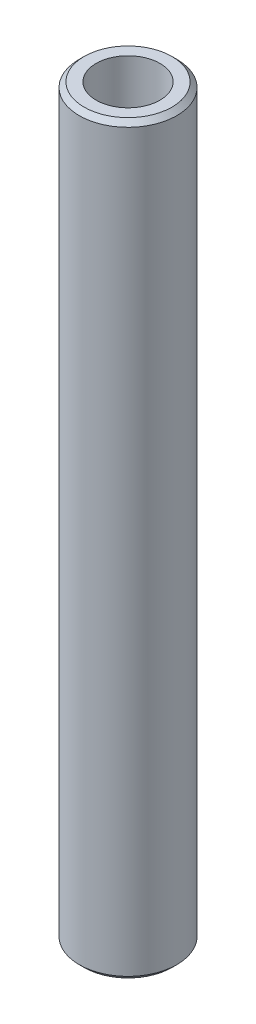
ISO-10303-21;
HEADER;
FILE_DESCRIPTION(('STEP AP214'),'2;1');
FILE_NAME('part.step','',(''),(''),'','','');
FILE_SCHEMA(('AUTOMOTIVE_DESIGN { 1 0 10303 214 1 1 1 1 }'));
ENDSEC;
DATA;
#1=APPLICATION_CONTEXT('core data for automotive mechanical design processes');
#2=APPLICATION_PROTOCOL_DEFINITION('international standard','automotive_design',2000,#1);
#3=PRODUCT_CONTEXT('',#1,'mechanical');
#4=PRODUCT('Part','Part','',(#3));
#5=PRODUCT_RELATED_PRODUCT_CATEGORY('part','',(#4));
#6=PRODUCT_DEFINITION_FORMATION('','',#4);
#7=PRODUCT_DEFINITION_CONTEXT('part definition',#1,'design');
#8=PRODUCT_DEFINITION('design','',#6,#7);
#9=PRODUCT_DEFINITION_SHAPE('','',#8);
#10=(LENGTH_UNIT() NAMED_UNIT(*) SI_UNIT(.MILLI.,.METRE.));
#11=(NAMED_UNIT(*) PLANE_ANGLE_UNIT() SI_UNIT($,.RADIAN.));
#12=(NAMED_UNIT(*) SI_UNIT($,.STERADIAN.) SOLID_ANGLE_UNIT());
#13=UNCERTAINTY_MEASURE_WITH_UNIT(LENGTH_MEASURE(1.E-05),#10,'distance_accuracy_value','');
#14=(GEOMETRIC_REPRESENTATION_CONTEXT(3) GLOBAL_UNCERTAINTY_ASSIGNED_CONTEXT((#13)) GLOBAL_UNIT_ASSIGNED_CONTEXT((#10,
#11,#12)) REPRESENTATION_CONTEXT('',''));
#15=CARTESIAN_POINT('',(0.,0.,0.));
#16=DIRECTION('',(0.,0.,1.));
#17=DIRECTION('',(1.,0.,0.));
#18=AXIS2_PLACEMENT_3D('',#15,#16,#17);
#19=CARTESIAN_POINT('',(0.,343.356689763253,0.));
#20=DIRECTION('',(0.,-1.,0.));
#21=DIRECTION('',(0.,0.,-1.));
#22=AXIS2_PLACEMENT_3D('',#19,#20,#21);
#23=CYLINDRICAL_SURFACE('',#22,22.5);
#24=CARTESIAN_POINT('',(0.,341.094203052417,0.));
#25=DIRECTION('',(0.,1.,0.));
#26=DIRECTION('',(0.,0.,1.));
#27=AXIS2_PLACEMENT_3D('',#24,#25,#26);
#28=CIRCLE('',#27,22.5);
#29=CARTESIAN_POINT('',(0.,341.094203052417,-22.5));
#30=VERTEX_POINT('',#29);
#31=EDGE_CURVE('E50',#30,#30,#28,.F.);
#32=CARTESIAN_POINT('',(0.,2.26248671083679,0.));
#33=DIRECTION('',(0.,1.,0.));
#34=DIRECTION('',(0.,0.,1.));
#35=AXIS2_PLACEMENT_3D('',#32,#33,#34);
#36=CIRCLE('',#35,22.5);
#37=CARTESIAN_POINT('',(0.,2.26248671083679,-22.5));
#38=VERTEX_POINT('',#37);
#39=EDGE_CURVE('E51',#38,#38,#36,.T.);
#40=CARTESIAN_POINT('',(0.,341.094203052417,-22.5));
#41=CARTESIAN_POINT('',(0.,337.564706007192,-22.5));
#42=CARTESIAN_POINT('',(0.,334.035208961967,-22.5));
#43=CARTESIAN_POINT('',(0.,326.976214871518,-22.5));
#44=CARTESIAN_POINT('',(0.,323.446717826293,-22.5));
#45=CARTESIAN_POINT('',(0.,316.387723735843,-22.5));
#46=CARTESIAN_POINT('',(0.,312.858226690619,-22.5));
#47=CARTESIAN_POINT('',(0.,305.799232600169,-22.5));
#48=CARTESIAN_POINT('',(0.,302.269735554944,-22.5));
#49=CARTESIAN_POINT('',(0.,295.210741464495,-22.5));
#50=CARTESIAN_POINT('',(0.,291.68124441927,-22.5));
#51=CARTESIAN_POINT('',(0.,284.62225032882,-22.5));
#52=CARTESIAN_POINT('',(0.,281.092753283596,-22.5));
#53=CARTESIAN_POINT('',(0.,274.033759193146,-22.5));
#54=CARTESIAN_POINT('',(0.,270.504262147921,-22.5));
#55=CARTESIAN_POINT('',(0.,263.445268057472,-22.5));
#56=CARTESIAN_POINT('',(0.,259.915771012247,-22.5));
#57=CARTESIAN_POINT('',(0.,252.856776921797,-22.5));
#58=CARTESIAN_POINT('',(0.,249.327279876572,-22.5));
#59=CARTESIAN_POINT('',(0.,242.268285786123,-22.5));
#60=CARTESIAN_POINT('',(0.,238.738788740898,-22.5));
#61=CARTESIAN_POINT('',(0.,231.679794650448,-22.5));
#62=CARTESIAN_POINT('',(0.,228.150297605224,-22.5));
#63=CARTESIAN_POINT('',(0.,221.091303514774,-22.5));
#64=CARTESIAN_POINT('',(0.,217.561806469549,-22.5));
#65=CARTESIAN_POINT('',(0.,210.5028123791,-22.5));
#66=CARTESIAN_POINT('',(0.,206.973315333875,-22.5));
#67=CARTESIAN_POINT('',(0.,199.914321243425,-22.5));
#68=CARTESIAN_POINT('',(0.,196.3848241982,-22.5));
#69=CARTESIAN_POINT('',(0.,189.325830107751,-22.5));
#70=CARTESIAN_POINT('',(0.,185.796333062526,-22.5));
#71=CARTESIAN_POINT('',(0.,178.737338972077,-22.5));
#72=CARTESIAN_POINT('',(0.,175.207841926852,-22.5));
#73=CARTESIAN_POINT('',(0.,168.148847836402,-22.5));
#74=CARTESIAN_POINT('',(0.,164.619350791177,-22.5));
#75=CARTESIAN_POINT('',(0.,157.560356700728,-22.5));
#76=CARTESIAN_POINT('',(0.,154.030859655503,-22.5));
#77=CARTESIAN_POINT('',(0.,146.971865565053,-22.5));
#78=CARTESIAN_POINT('',(0.,143.442368519829,-22.5));
#79=CARTESIAN_POINT('',(0.,136.383374429379,-22.5));
#80=CARTESIAN_POINT('',(0.,132.853877384154,-22.5));
#81=CARTESIAN_POINT('',(0.,125.794883293705,-22.5));
#82=CARTESIAN_POINT('',(0.,122.26538624848,-22.5));
#83=CARTESIAN_POINT('',(0.,115.20639215803,-22.5));
#84=CARTESIAN_POINT('',(0.,111.676895112805,-22.5));
#85=CARTESIAN_POINT('',(0.,104.617901022356,-22.5));
#86=CARTESIAN_POINT('',(0.,101.088403977131,-22.5));
#87=CARTESIAN_POINT('',(0.,94.0294098866814,-22.5));
#88=CARTESIAN_POINT('',(0.,90.4999128414566,-22.5));
#89=CARTESIAN_POINT('',(0.,83.4409187510071,-22.5));
#90=CARTESIAN_POINT('',(0.,79.9114217057823,-22.5));
#91=CARTESIAN_POINT('',(0.,72.8524276153327,-22.5));
#92=CARTESIAN_POINT('',(0.,69.322930570108,-22.5));
#93=CARTESIAN_POINT('',(0.,62.2639364796584,-22.5));
#94=CARTESIAN_POINT('',(0.,58.7344394344336,-22.5));
#95=CARTESIAN_POINT('',(0.,51.675445343984,-22.5));
#96=CARTESIAN_POINT('',(0.,48.1459482987592,-22.5));
#97=CARTESIAN_POINT('',(0.,41.0869542083096,-22.5));
#98=CARTESIAN_POINT('',(0.,37.5574571630848,-22.5));
#99=CARTESIAN_POINT('',(0.,30.4984630726352,-22.5));
#100=CARTESIAN_POINT('',(0.,26.9689660274104,-22.5));
#101=CARTESIAN_POINT('',(0.,19.9099719369608,-22.5));
#102=CARTESIAN_POINT('',(0.,16.380474891736,-22.5));
#103=CARTESIAN_POINT('',(0.,9.32148080128638,-22.5));
#104=CARTESIAN_POINT('',(0.,5.79198375606158,-22.5));
#105=CARTESIAN_POINT('',(0.,2.26248671083679,-22.5));
#106=B_SPLINE_CURVE_WITH_KNOTS('',3,(#40,#41,#42,#43,#44,#45,#46,#47,#48,#49,#50,#51,#52,#53,
#54,#55,#56,#57,#58,#59,#60,#61,#62,#63,#64,#65,#66,#67,#68,#69,#70,#71,#72,#73,#74,#75,#76,#77,
#78,#79,#80,#81,#82,#83,#84,#85,#86,#87,#88,#89,#90,#91,#92,#93,#94,#95,#96,#97,#98,#99,#100,
#101,#102,#103,#104,#105),.UNSPECIFIED.,.F.,.F.,(4,2,2,2,2,2,2,2,2,2,2,2,2,2,2,2,2,2,2,2,2,2,2,
2,2,2,2,2,2,2,2,2,4),(0.,10.5884911356744,21.1769822713488,31.7654734070232,42.3539645426976,
52.9424556783719,63.5309468140463,74.1194379497207,84.7079290853951,95.2964202210695,
105.884911356744,116.473402492418,127.061893628093,137.650384763767,148.238875899441,
158.827367035116,169.41585817079,180.004349306465,190.592840442139,201.181331577813,
211.769822713488,222.358313849162,232.946804984836,243.535296120511,254.123787256185,
264.71227839186,275.300769527534,285.889260663208,296.477751798883,307.066242934557,
317.654734070231,328.243225205906,338.83171634158),.UNSPECIFIED.);
#107=EDGE_CURVE('BSEAM39',#30,#38,#106,.T.);
#108=ORIENTED_EDGE('',*,*,#31,.T.);
#109=ORIENTED_EDGE('',*,*,#39,.T.);
#110=ORIENTED_EDGE('',*,*,#107,.T.);
#111=ORIENTED_EDGE('',*,*,#107,.F.);
#112=EDGE_LOOP('',(#108,#110,#109,#111));
#113=FACE_BOUND('',#112,.T.);
#114=ADVANCED_FACE('F39',(#113),#23,.T.);
#115=CARTESIAN_POINT('',(0.,343.356689763253,0.));
#116=DIRECTION('',(0.,1.,0.));
#117=DIRECTION('',(0.,0.,1.));
#118=AXIS2_PLACEMENT_3D('',#115,#116,#117);
#119=PLANE('',#118);
#120=CARTESIAN_POINT('',(0.,343.356689763253,0.));
#121=DIRECTION('',(0.,1.,0.));
#122=DIRECTION('',(0.,0.,1.));
#123=AXIS2_PLACEMENT_3D('',#120,#121,#122);
#124=CIRCLE('',#123,20.2375132891636);
#125=CARTESIAN_POINT('',(0.,343.356689763253,20.2375132891636));
#126=VERTEX_POINT('',#125);
#127=EDGE_CURVE('E54',#126,#126,#124,.T.);
#128=ORIENTED_EDGE('',*,*,#127,.T.);
#129=EDGE_LOOP('',(#128));
#130=FACE_BOUND('',#129,.T.);
#131=CARTESIAN_POINT('',(0.,343.356689763253,0.));
#132=DIRECTION('',(0.,1.,0.));
#133=DIRECTION('',(0.,0.,1.));
#134=AXIS2_PLACEMENT_3D('',#131,#132,#133);
#135=CIRCLE('',#134,14.7062033141713);
#136=CARTESIAN_POINT('',(0.,343.356689763253,-14.7062033141713));
#137=VERTEX_POINT('',#136);
#138=EDGE_CURVE('E58',#137,#137,#135,.T.);
#139=ORIENTED_EDGE('',*,*,#138,.F.);
#140=EDGE_LOOP('',(#139));
#141=FACE_BOUND('',#140,.T.);
#142=ADVANCED_FACE('F69',(#130,#141),#119,.T.);
#143=CARTESIAN_POINT('',(0.,0.,0.));
#144=DIRECTION('',(0.,1.,0.));
#145=DIRECTION('',(0.,0.,1.));
#146=AXIS2_PLACEMENT_3D('',#143,#144,#145);
#147=PLANE('',#146);
#148=CARTESIAN_POINT('',(0.,0.,0.));
#149=DIRECTION('',(0.,1.,0.));
#150=DIRECTION('',(0.,0.,1.));
#151=AXIS2_PLACEMENT_3D('',#148,#149,#150);
#152=CIRCLE('',#151,20.2375132891632);
#153=CARTESIAN_POINT('',(0.,0.,20.2375132891632));
#154=VERTEX_POINT('',#153);
#155=EDGE_CURVE('E10',#154,#154,#152,.F.);
#156=ORIENTED_EDGE('',*,*,#155,.T.);
#157=EDGE_LOOP('',(#156));
#158=FACE_BOUND('',#157,.T.);
#159=CARTESIAN_POINT('',(0.,0.,0.));
#160=DIRECTION('',(0.,1.,0.));
#161=DIRECTION('',(0.,0.,1.));
#162=AXIS2_PLACEMENT_3D('',#159,#160,#161);
#163=CIRCLE('',#162,14.7062033141713);
#164=CARTESIAN_POINT('',(0.,0.,-14.7062033141713));
#165=VERTEX_POINT('',#164);
#166=EDGE_CURVE('E63',#165,#165,#163,.T.);
#167=ORIENTED_EDGE('',*,*,#166,.T.);
#168=EDGE_LOOP('',(#167));
#169=FACE_BOUND('',#168,.T.);
#170=ADVANCED_FACE('F75',(#158,#169),#147,.F.);
#171=CARTESIAN_POINT('',(0.,343.356689763253,0.));
#172=DIRECTION('',(0.,-1.,0.));
#173=DIRECTION('',(0.,0.,-1.));
#174=AXIS2_PLACEMENT_3D('',#171,#172,#173);
#175=CYLINDRICAL_SURFACE('',#174,14.7062033141713);
#176=CARTESIAN_POINT('',(0.,343.356689763253,-14.7062033141713));
#177=CARTESIAN_POINT('',(0.,339.780057578219,-14.7062033141713));
#178=CARTESIAN_POINT('',(0.,336.203425393186,-14.7062033141713));
#179=CARTESIAN_POINT('',(0.,329.050161023118,-14.7062033141713));
#180=CARTESIAN_POINT('',(0.,325.473528838084,-14.7062033141713));
#181=CARTESIAN_POINT('',(0.,318.320264468016,-14.7062033141713));
#182=CARTESIAN_POINT('',(0.,314.743632282982,-14.7062033141713));
#183=CARTESIAN_POINT('',(0.,307.590367912914,-14.7062033141713));
#184=CARTESIAN_POINT('',(0.,304.013735727881,-14.7062033141713));
#185=CARTESIAN_POINT('',(0.,296.860471357813,-14.7062033141713));
#186=CARTESIAN_POINT('',(0.,293.283839172779,-14.7062033141713));
#187=CARTESIAN_POINT('',(0.,286.130574802711,-14.7062033141713));
#188=CARTESIAN_POINT('',(0.,282.553942617677,-14.7062033141713));
#189=CARTESIAN_POINT('',(0.,275.400678247609,-14.7062033141713));
#190=CARTESIAN_POINT('',(0.,271.824046062576,-14.7062033141713));
#191=CARTESIAN_POINT('',(0.,264.670781692508,-14.7062033141713));
#192=CARTESIAN_POINT('',(0.,261.094149507474,-14.7062033141713));
#193=CARTESIAN_POINT('',(0.,253.940885137406,-14.7062033141713));
#194=CARTESIAN_POINT('',(0.,250.364252952372,-14.7062033141713));
#195=CARTESIAN_POINT('',(0.,243.210988582304,-14.7062033141713));
#196=CARTESIAN_POINT('',(0.,239.634356397271,-14.7062033141713));
#197=CARTESIAN_POINT('',(0.,232.481092027203,-14.7062033141713));
#198=CARTESIAN_POINT('',(0.,228.904459842169,-14.7062033141713));
#199=CARTESIAN_POINT('',(0.,221.751195472101,-14.7062033141713));
#200=CARTESIAN_POINT('',(0.,218.174563287067,-14.7062033141713));
#201=CARTESIAN_POINT('',(0.,211.021298916999,-14.7062033141713));
#202=CARTESIAN_POINT('',(0.,207.444666731966,-14.7062033141713));
#203=CARTESIAN_POINT('',(0.,200.291402361898,-14.7062033141713));
#204=CARTESIAN_POINT('',(0.,196.714770176864,-14.7062033141713));
#205=CARTESIAN_POINT('',(0.,189.561505806796,-14.7062033141713));
#206=CARTESIAN_POINT('',(0.,185.984873621762,-14.7062033141713));
#207=CARTESIAN_POINT('',(0.,178.831609251694,-14.7062033141713));
#208=CARTESIAN_POINT('',(0.,175.254977066661,-14.7062033141713));
#209=CARTESIAN_POINT('',(0.,168.101712696593,-14.7062033141713));
#210=CARTESIAN_POINT('',(0.,164.525080511559,-14.7062033141713));
#211=CARTESIAN_POINT('',(0.,157.371816141491,-14.7062033141713));
#212=CARTESIAN_POINT('',(0.,153.795183956457,-14.7062033141713));
#213=CARTESIAN_POINT('',(0.,146.641919586389,-14.7062033141713));
#214=CARTESIAN_POINT('',(0.,143.065287401356,-14.7062033141713));
#215=CARTESIAN_POINT('',(0.,135.912023031288,-14.7062033141713));
#216=CARTESIAN_POINT('',(0.,132.335390846254,-14.7062033141713));
#217=CARTESIAN_POINT('',(0.,125.182126476186,-14.7062033141713));
#218=CARTESIAN_POINT('',(0.,121.605494291152,-14.7062033141713));
#219=CARTESIAN_POINT('',(0.,114.452229921084,-14.7062033141713));
#220=CARTESIAN_POINT('',(0.,110.875597736051,-14.7062033141713));
#221=CARTESIAN_POINT('',(0.,103.722333365983,-14.7062033141713));
#222=CARTESIAN_POINT('',(0.,100.145701180949,-14.7062033141713));
#223=CARTESIAN_POINT('',(0.,92.9924368108811,-14.7062033141713));
#224=CARTESIAN_POINT('',(0.,89.4158046258472,-14.7062033141713));
#225=CARTESIAN_POINT('',(0.,82.2625402557794,-14.7062033141713));
#226=CARTESIAN_POINT('',(0.,78.6859080707455,-14.7062033141713));
#227=CARTESIAN_POINT('',(0.,71.5326437006778,-14.7062033141713));
#228=CARTESIAN_POINT('',(0.,67.9560115156439,-14.7062033141713));
#229=CARTESIAN_POINT('',(0.,60.8027471455761,-14.7062033141713));
#230=CARTESIAN_POINT('',(0.,57.2261149605422,-14.7062033141713));
#231=CARTESIAN_POINT('',(0.,50.0728505904744,-14.7062033141713));
#232=CARTESIAN_POINT('',(0.,46.4962184054405,-14.7062033141713));
#233=CARTESIAN_POINT('',(0.,39.3429540353727,-14.7062033141713));
#234=CARTESIAN_POINT('',(0.,35.7663218503388,-14.7062033141713));
#235=CARTESIAN_POINT('',(0.,28.6130574802711,-14.7062033141713));
#236=CARTESIAN_POINT('',(0.,25.0364252952372,-14.7062033141713));
#237=CARTESIAN_POINT('',(0.,17.8831609251694,-14.7062033141713));
#238=CARTESIAN_POINT('',(0.,14.3065287401355,-14.7062033141713));
#239=CARTESIAN_POINT('',(0.,7.15326437006771,-14.7062033141713));
#240=CARTESIAN_POINT('',(0.,3.57663218503383,-14.7062033141713));
#241=CARTESIAN_POINT('',(0.,0.,-14.7062033141713));
#242=B_SPLINE_CURVE_WITH_KNOTS('',3,(#176,#177,#178,#179,#180,#181,#182,#183,#184,#185,#186,
#187,#188,#189,#190,#191,#192,#193,#194,#195,#196,#197,#198,#199,#200,#201,#202,#203,#204,#205,
#206,#207,#208,#209,#210,#211,#212,#213,#214,#215,#216,#217,#218,#219,#220,#221,#222,#223,#224,
#225,#226,#227,#228,#229,#230,#231,#232,#233,#234,#235,#236,#237,#238,#239,#240,#241),
.UNSPECIFIED.,.F.,.F.,(4,2,2,2,2,2,2,2,2,2,2,2,2,2,2,2,2,2,2,2,2,2,2,2,2,2,2,2,2,2,2,2,4),(0.,
10.7298965551017,21.4597931102033,32.1896896653051,42.9195862204067,53.6494827755084,
64.37937933061,75.1092758857117,85.8391724408134,96.569068995915,107.298965551017,
118.028862106118,128.75875866122,139.488655216322,150.218551771423,160.948448326525,
171.678344881627,182.408241436728,193.13813799183,203.868034546932,214.597931102033,
225.327827657135,236.057724212237,246.787620767338,257.51751732244,268.247413877542,
278.977310432643,289.707206987745,300.437103542847,311.167000097948,321.89689665305,
332.626793208152,343.356689763253),.UNSPECIFIED.);
#243=EDGE_CURVE('BSEAM70',#137,#165,#242,.T.);
#244=ORIENTED_EDGE('',*,*,#138,.T.);
#245=ORIENTED_EDGE('',*,*,#166,.F.);
#246=ORIENTED_EDGE('',*,*,#243,.T.);
#247=ORIENTED_EDGE('',*,*,#243,.F.);
#248=EDGE_LOOP('',(#244,#246,#245,#247));
#249=FACE_BOUND('',#248,.T.);
#250=ADVANCED_FACE('F70',(#249),#175,.F.);
#251=CARTESIAN_POINT('',(0.,343.356689763253,0.));
#252=DIRECTION('',(0.,-1.,0.));
#253=DIRECTION('',(0.,0.,-1.));
#254=AXIS2_PLACEMENT_3D('',#251,#252,#253);
#255=CONICAL_SURFACE('',#254,20.2375132891636,0.785398163397451);
#256=ORIENTED_EDGE('',*,*,#31,.F.);
#257=EDGE_LOOP('',(#256));
#258=FACE_BOUND('',#257,.T.);
#259=ORIENTED_EDGE('',*,*,#127,.F.);
#260=EDGE_LOOP('',(#259));
#261=FACE_BOUND('',#260,.T.);
#262=ADVANCED_FACE('F81',(#258,#261),#255,.T.);
#263=CARTESIAN_POINT('',(0.,2.26248671083679,0.));
#264=DIRECTION('',(0.,1.,0.));
#265=DIRECTION('',(0.,0.,1.));
#266=AXIS2_PLACEMENT_3D('',#263,#264,#265);
#267=CONICAL_SURFACE('',#266,22.5,0.785398163397451);
#268=ORIENTED_EDGE('',*,*,#155,.F.);
#269=EDGE_LOOP('',(#268));
#270=FACE_BOUND('',#269,.T.);
#271=ORIENTED_EDGE('',*,*,#39,.F.);
#272=EDGE_LOOP('',(#271));
#273=FACE_BOUND('',#272,.T.);
#274=ADVANCED_FACE('F45',(#270,#273),#267,.T.);
#275=CLOSED_SHELL('',(#114,#142,#170,#250,#262,#274));
#276=MANIFOLD_SOLID_BREP('B2',#275);
#277=ADVANCED_BREP_SHAPE_REPRESENTATION('',(#18,#276),#14);
#278=SHAPE_DEFINITION_REPRESENTATION(#9,#277);
ENDSEC;
END-ISO-10303-21;
